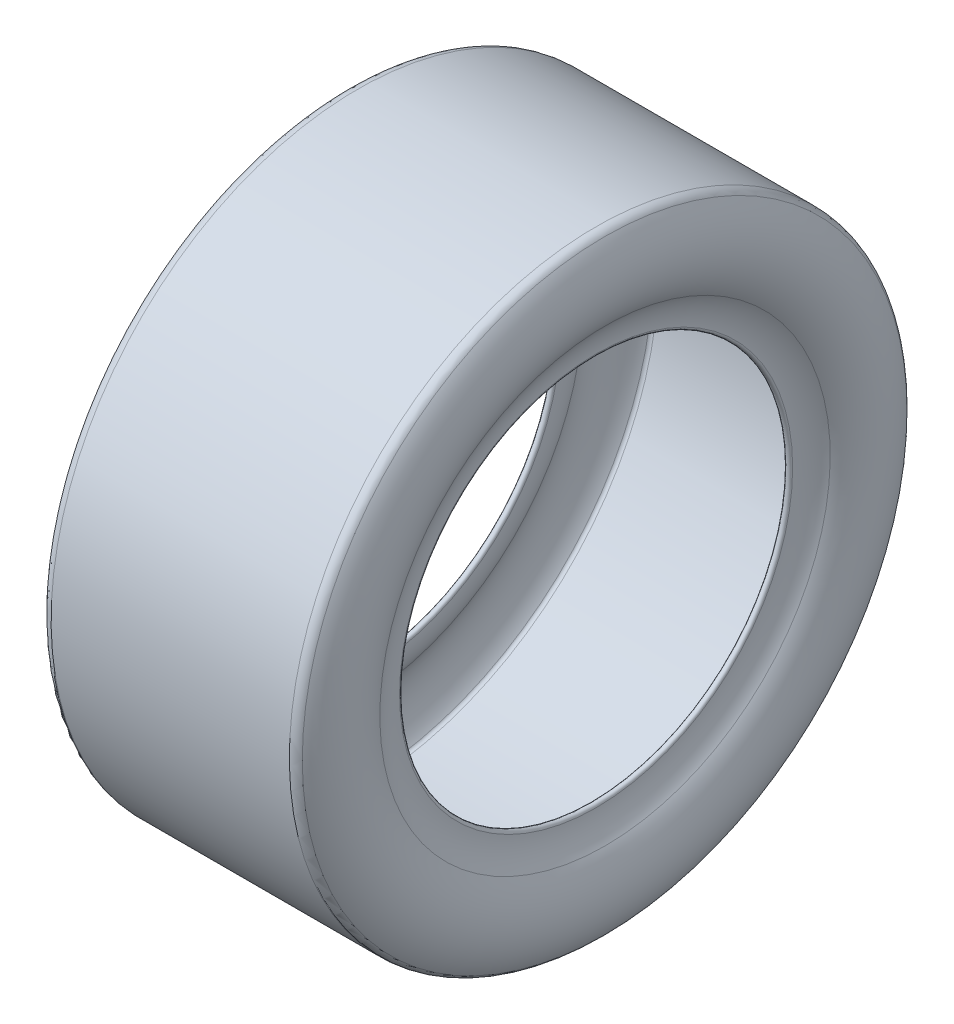
ISO-10303-21;
HEADER;
FILE_DESCRIPTION(('STEP AP214'),'2;1');
FILE_NAME('part.step','',(''),(''),'','','');
FILE_SCHEMA(('AUTOMOTIVE_DESIGN { 1 0 10303 214 1 1 1 1 }'));
ENDSEC;
DATA;
#1=APPLICATION_CONTEXT('core data for automotive mechanical design processes');
#2=APPLICATION_PROTOCOL_DEFINITION('international standard','automotive_design',2000,#1);
#3=PRODUCT_CONTEXT('',#1,'mechanical');
#4=PRODUCT('Part','Part','',(#3));
#5=PRODUCT_RELATED_PRODUCT_CATEGORY('part','',(#4));
#6=PRODUCT_DEFINITION_FORMATION('','',#4);
#7=PRODUCT_DEFINITION_CONTEXT('part definition',#1,'design');
#8=PRODUCT_DEFINITION('design','',#6,#7);
#9=PRODUCT_DEFINITION_SHAPE('','',#8);
#10=(LENGTH_UNIT() NAMED_UNIT(*) SI_UNIT(.MILLI.,.METRE.));
#11=(NAMED_UNIT(*) PLANE_ANGLE_UNIT() SI_UNIT($,.RADIAN.));
#12=(NAMED_UNIT(*) SI_UNIT($,.STERADIAN.) SOLID_ANGLE_UNIT());
#13=UNCERTAINTY_MEASURE_WITH_UNIT(LENGTH_MEASURE(1.E-05),#10,'distance_accuracy_value','');
#14=(GEOMETRIC_REPRESENTATION_CONTEXT(3) GLOBAL_UNCERTAINTY_ASSIGNED_CONTEXT((#13)) GLOBAL_UNIT_ASSIGNED_CONTEXT((#10,
#11,#12)) REPRESENTATION_CONTEXT('',''));
#15=CARTESIAN_POINT('',(0.,0.,0.));
#16=DIRECTION('',(0.,0.,1.));
#17=DIRECTION('',(1.,0.,0.));
#18=AXIS2_PLACEMENT_3D('',#15,#16,#17);
#19=CARTESIAN_POINT('',(-101.6,0.,0.));
#20=DIRECTION('',(-1.,0.,0.));
#21=DIRECTION('',(0.,-1.,0.));
#22=AXIS2_PLACEMENT_3D('',#19,#20,#21);
#23=TOROIDAL_SURFACE('',#22,252.733463857242,8.88653614275802);
#24=CARTESIAN_POINT('',(-108.860167055037,0.,0.));
#25=DIRECTION('',(-1.,0.,0.));
#26=DIRECTION('',(0.,-1.,0.));
#27=AXIS2_PLACEMENT_3D('',#24,#25,#26);
#28=CIRCLE('',#27,257.857963730351);
#29=CARTESIAN_POINT('',(-108.860167055037,-257.857963730351,0.));
#30=VERTEX_POINT('',#29);
#31=EDGE_CURVE('E10',#30,#30,#28,.T.);
#32=ORIENTED_EDGE('',*,*,#31,.F.);
#33=EDGE_LOOP('',(#32));
#34=FACE_BOUND('',#33,.T.);
#35=CARTESIAN_POINT('',(-101.6,0.,0.));
#36=DIRECTION('',(-1.,0.,0.));
#37=DIRECTION('',(0.,-1.,0.));
#38=AXIS2_PLACEMENT_3D('',#35,#36,#37);
#39=CIRCLE('',#38,261.62);
#40=CARTESIAN_POINT('',(-101.6,-261.62,0.));
#41=VERTEX_POINT('',#40);
#42=EDGE_CURVE('E82',#41,#41,#39,.T.);
#43=ORIENTED_EDGE('',*,*,#42,.T.);
#44=EDGE_LOOP('',(#43));
#45=FACE_BOUND('',#44,.T.);
#46=ADVANCED_FACE('F30',(#34,#45),#23,.T.);
#47=CARTESIAN_POINT('',(-61.8992741383217,0.,0.));
#48=DIRECTION('',(-1.,0.,0.));
#49=DIRECTION('',(0.,-1.,0.));
#50=AXIS2_PLACEMENT_3D('',#47,#48,#49);
#51=TOROIDAL_SURFACE('',#50,224.711193419351,57.4807258616782);
#52=CARTESIAN_POINT('',(-109.209263361328,0.,0.));
#53=DIRECTION('',(-1.,0.,0.));
#54=DIRECTION('',(0.,-1.,0.));
#55=AXIS2_PLACEMENT_3D('',#52,#53,#54);
#56=CIRCLE('',#55,192.064619857882);
#57=CARTESIAN_POINT('',(-109.209263361328,-192.064619857882,0.));
#58=VERTEX_POINT('',#57);
#59=EDGE_CURVE('E36',#58,#58,#56,.T.);
#60=ORIENTED_EDGE('',*,*,#59,.F.);
#61=EDGE_LOOP('',(#60));
#62=FACE_BOUND('',#61,.T.);
#63=ORIENTED_EDGE('',*,*,#31,.T.);
#64=EDGE_LOOP('',(#63));
#65=FACE_BOUND('',#64,.T.);
#66=ADVANCED_FACE('F167',(#62,#65),#51,.T.);
#67=CARTESIAN_POINT('',(-144.604356205504,0.,0.));
#68=DIRECTION('',(-1.,0.,0.));
#69=DIRECTION('',(0.,-1.,0.));
#70=AXIS2_PLACEMENT_3D('',#67,#68,#69);
#71=TOROIDAL_SURFACE('',#70,167.64,43.0043562055043);
#72=CARTESIAN_POINT('',(-101.6,0.,0.));
#73=DIRECTION('',(-1.,0.,0.));
#74=DIRECTION('',(0.,-1.,0.));
#75=AXIS2_PLACEMENT_3D('',#72,#73,#74);
#76=CIRCLE('',#75,167.64);
#77=CARTESIAN_POINT('',(-101.6,-167.64,0.));
#78=VERTEX_POINT('',#77);
#79=EDGE_CURVE('E40',#78,#78,#76,.T.);
#80=ORIENTED_EDGE('',*,*,#79,.F.);
#81=EDGE_LOOP('',(#80));
#82=FACE_BOUND('',#81,.T.);
#83=ORIENTED_EDGE('',*,*,#59,.T.);
#84=EDGE_LOOP('',(#83));
#85=FACE_BOUND('',#84,.T.);
#86=ADVANCED_FACE('F162',(#82,#85),#71,.F.);
#87=CARTESIAN_POINT('',(-99.06,0.,0.));
#88=DIRECTION('',(-1.,0.,0.));
#89=DIRECTION('',(0.,-1.,0.));
#90=AXIS2_PLACEMENT_3D('',#87,#88,#89);
#91=TOROIDAL_SURFACE('',#90,167.64,2.53999999999999);
#92=CARTESIAN_POINT('',(-96.52,0.,0.));
#93=DIRECTION('',(-1.,0.,0.));
#94=DIRECTION('',(0.,-1.,0.));
#95=AXIS2_PLACEMENT_3D('',#92,#93,#94);
#96=CIRCLE('',#95,167.64);
#97=CARTESIAN_POINT('',(-96.5199999999999,-167.64,0.));
#98=VERTEX_POINT('',#97);
#99=EDGE_CURVE('E44',#98,#98,#96,.T.);
#100=ORIENTED_EDGE('',*,*,#99,.F.);
#101=EDGE_LOOP('',(#100));
#102=FACE_BOUND('',#101,.T.);
#103=ORIENTED_EDGE('',*,*,#79,.T.);
#104=EDGE_LOOP('',(#103));
#105=FACE_BOUND('',#104,.T.);
#106=ADVANCED_FACE('F156',(#102,#105),#91,.T.);
#107=CARTESIAN_POINT('',(-144.604356205504,0.,0.));
#108=DIRECTION('',(-1.,0.,0.));
#109=DIRECTION('',(0.,-1.,0.));
#110=AXIS2_PLACEMENT_3D('',#107,#108,#109);
#111=TOROIDAL_SURFACE('',#110,167.64,48.0843562055044);
#112=CARTESIAN_POINT('',(-105.028127134357,0.,0.));
#113=DIRECTION('',(-1.,0.,0.));
#114=DIRECTION('',(0.,-1.,0.));
#115=AXIS2_PLACEMENT_3D('',#112,#113,#114);
#116=CIRCLE('',#115,194.949840794224);
#117=CARTESIAN_POINT('',(-105.028127134357,-194.949840794224,0.));
#118=VERTEX_POINT('',#117);
#119=EDGE_CURVE('E49',#118,#118,#116,.T.);
#120=ORIENTED_EDGE('',*,*,#119,.F.);
#121=EDGE_LOOP('',(#120));
#122=FACE_BOUND('',#121,.T.);
#123=ORIENTED_EDGE('',*,*,#99,.T.);
#124=EDGE_LOOP('',(#123));
#125=FACE_BOUND('',#124,.T.);
#126=ADVANCED_FACE('F150',(#122,#125),#111,.T.);
#127=CARTESIAN_POINT('',(-61.8992741383217,0.,0.));
#128=DIRECTION('',(-1.,0.,0.));
#129=DIRECTION('',(0.,-1.,0.));
#130=AXIS2_PLACEMENT_3D('',#127,#128,#129);
#131=TOROIDAL_SURFACE('',#130,224.711193419351,52.400725861678);
#132=CARTESIAN_POINT('',(-104.709883069567,0.,0.));
#133=DIRECTION('',(-1.,0.,0.));
#134=DIRECTION('',(0.,-1.,0.));
#135=AXIS2_PLACEMENT_3D('',#132,#133,#134);
#136=CIRCLE('',#135,254.928536680576);
#137=CARTESIAN_POINT('',(-104.709883069567,-254.928536680576,0.));
#138=VERTEX_POINT('',#137);
#139=EDGE_CURVE('E52',#138,#138,#136,.T.);
#140=ORIENTED_EDGE('',*,*,#139,.F.);
#141=EDGE_LOOP('',(#140));
#142=FACE_BOUND('',#141,.T.);
#143=ORIENTED_EDGE('',*,*,#119,.T.);
#144=EDGE_LOOP('',(#143));
#145=FACE_BOUND('',#144,.T.);
#146=ADVANCED_FACE('F144',(#142,#145),#131,.F.);
#147=CARTESIAN_POINT('',(-101.6,0.,0.));
#148=DIRECTION('',(-1.,0.,0.));
#149=DIRECTION('',(0.,-1.,0.));
#150=AXIS2_PLACEMENT_3D('',#147,#148,#149);
#151=TOROIDAL_SURFACE('',#150,252.733463857242,3.80653614275777);
#152=CARTESIAN_POINT('',(-101.6,0.,0.));
#153=DIRECTION('',(-1.,0.,0.));
#154=DIRECTION('',(0.,-1.,0.));
#155=AXIS2_PLACEMENT_3D('',#152,#153,#154);
#156=CIRCLE('',#155,256.54);
#157=CARTESIAN_POINT('',(-101.6,-256.54,0.));
#158=VERTEX_POINT('',#157);
#159=EDGE_CURVE('E55',#158,#158,#156,.T.);
#160=ORIENTED_EDGE('',*,*,#159,.F.);
#161=EDGE_LOOP('',(#160));
#162=FACE_BOUND('',#161,.T.);
#163=ORIENTED_EDGE('',*,*,#139,.T.);
#164=EDGE_LOOP('',(#163));
#165=FACE_BOUND('',#164,.T.);
#166=ADVANCED_FACE('F138',(#162,#165),#151,.F.);
#167=CARTESIAN_POINT('',(-23.1787160204675,0.,0.));
#168=DIRECTION('',(-1.,0.,0.));
#169=DIRECTION('',(0.,-1.,0.));
#170=AXIS2_PLACEMENT_3D('',#167,#168,#169);
#171=CYLINDRICAL_SURFACE('',#170,256.54);
#172=CARTESIAN_POINT('',(101.6,0.,0.));
#173=DIRECTION('',(-1.,0.,0.));
#174=DIRECTION('',(0.,-1.,0.));
#175=AXIS2_PLACEMENT_3D('',#172,#173,#174);
#176=CIRCLE('',#175,256.54);
#177=CARTESIAN_POINT('',(101.6,-256.54,0.));
#178=VERTEX_POINT('',#177);
#179=EDGE_CURVE('E58',#178,#178,#176,.T.);
#180=ORIENTED_EDGE('',*,*,#179,.F.);
#181=EDGE_LOOP('',(#180));
#182=FACE_BOUND('',#181,.T.);
#183=ORIENTED_EDGE('',*,*,#159,.T.);
#184=EDGE_LOOP('',(#183));
#185=FACE_BOUND('',#184,.T.);
#186=ADVANCED_FACE('F132',(#182,#185),#171,.F.);
#187=CARTESIAN_POINT('',(101.6,0.,0.));
#188=DIRECTION('',(-1.,0.,0.));
#189=DIRECTION('',(0.,-1.,0.));
#190=AXIS2_PLACEMENT_3D('',#187,#188,#189);
#191=TOROIDAL_SURFACE('',#190,252.733463857242,3.80653614275777);
#192=CARTESIAN_POINT('',(104.709883069567,0.,0.));
#193=DIRECTION('',(-1.,0.,0.));
#194=DIRECTION('',(0.,-1.,0.));
#195=AXIS2_PLACEMENT_3D('',#192,#193,#194);
#196=CIRCLE('',#195,254.928536680576);
#197=CARTESIAN_POINT('',(104.709883069567,-254.928536680576,0.));
#198=VERTEX_POINT('',#197);
#199=EDGE_CURVE('E61',#198,#198,#196,.T.);
#200=ORIENTED_EDGE('',*,*,#199,.F.);
#201=EDGE_LOOP('',(#200));
#202=FACE_BOUND('',#201,.T.);
#203=ORIENTED_EDGE('',*,*,#179,.T.);
#204=EDGE_LOOP('',(#203));
#205=FACE_BOUND('',#204,.T.);
#206=ADVANCED_FACE('F126',(#202,#205),#191,.F.);
#207=CARTESIAN_POINT('',(61.8992741383218,0.,0.));
#208=DIRECTION('',(-1.,0.,0.));
#209=DIRECTION('',(0.,-1.,0.));
#210=AXIS2_PLACEMENT_3D('',#207,#208,#209);
#211=TOROIDAL_SURFACE('',#210,224.711193419351,52.400725861678);
#212=CARTESIAN_POINT('',(105.028127134357,0.,0.));
#213=DIRECTION('',(-1.,0.,0.));
#214=DIRECTION('',(0.,-1.,0.));
#215=AXIS2_PLACEMENT_3D('',#212,#213,#214);
#216=CIRCLE('',#215,194.949840794224);
#217=CARTESIAN_POINT('',(105.028127134357,-194.949840794224,0.));
#218=VERTEX_POINT('',#217);
#219=EDGE_CURVE('E64',#218,#218,#216,.T.);
#220=ORIENTED_EDGE('',*,*,#219,.F.);
#221=EDGE_LOOP('',(#220));
#222=FACE_BOUND('',#221,.T.);
#223=ORIENTED_EDGE('',*,*,#199,.T.);
#224=EDGE_LOOP('',(#223));
#225=FACE_BOUND('',#224,.T.);
#226=ADVANCED_FACE('F120',(#222,#225),#211,.F.);
#227=CARTESIAN_POINT('',(144.604356205504,0.,0.));
#228=DIRECTION('',(-1.,0.,0.));
#229=DIRECTION('',(0.,-1.,0.));
#230=AXIS2_PLACEMENT_3D('',#227,#228,#229);
#231=TOROIDAL_SURFACE('',#230,167.64,48.0843562055044);
#232=CARTESIAN_POINT('',(96.52,0.,0.));
#233=DIRECTION('',(-1.,0.,0.));
#234=DIRECTION('',(0.,-1.,0.));
#235=AXIS2_PLACEMENT_3D('',#232,#233,#234);
#236=CIRCLE('',#235,167.64);
#237=CARTESIAN_POINT('',(96.5200000000001,-167.64,0.));
#238=VERTEX_POINT('',#237);
#239=EDGE_CURVE('E67',#238,#238,#236,.T.);
#240=ORIENTED_EDGE('',*,*,#239,.F.);
#241=EDGE_LOOP('',(#240));
#242=FACE_BOUND('',#241,.T.);
#243=ORIENTED_EDGE('',*,*,#219,.T.);
#244=EDGE_LOOP('',(#243));
#245=FACE_BOUND('',#244,.T.);
#246=ADVANCED_FACE('F114',(#242,#245),#231,.T.);
#247=CARTESIAN_POINT('',(99.06,0.,0.));
#248=DIRECTION('',(-1.,0.,0.));
#249=DIRECTION('',(0.,-1.,0.));
#250=AXIS2_PLACEMENT_3D('',#247,#248,#249);
#251=TOROIDAL_SURFACE('',#250,167.64,2.53999999999999);
#252=CARTESIAN_POINT('',(101.6,0.,0.));
#253=DIRECTION('',(-1.,0.,0.));
#254=DIRECTION('',(0.,-1.,0.));
#255=AXIS2_PLACEMENT_3D('',#252,#253,#254);
#256=CIRCLE('',#255,167.64);
#257=CARTESIAN_POINT('',(101.6,-167.64,0.));
#258=VERTEX_POINT('',#257);
#259=EDGE_CURVE('E70',#258,#258,#256,.T.);
#260=ORIENTED_EDGE('',*,*,#259,.F.);
#261=EDGE_LOOP('',(#260));
#262=FACE_BOUND('',#261,.T.);
#263=ORIENTED_EDGE('',*,*,#239,.T.);
#264=EDGE_LOOP('',(#263));
#265=FACE_BOUND('',#264,.T.);
#266=ADVANCED_FACE('F108',(#262,#265),#251,.T.);
#267=CARTESIAN_POINT('',(144.604356205504,0.,0.));
#268=DIRECTION('',(-1.,0.,0.));
#269=DIRECTION('',(0.,-1.,0.));
#270=AXIS2_PLACEMENT_3D('',#267,#268,#269);
#271=TOROIDAL_SURFACE('',#270,167.64,43.0043562055043);
#272=CARTESIAN_POINT('',(109.209263361328,0.,0.));
#273=DIRECTION('',(-1.,0.,0.));
#274=DIRECTION('',(0.,-1.,0.));
#275=AXIS2_PLACEMENT_3D('',#272,#273,#274);
#276=CIRCLE('',#275,192.064619857882);
#277=CARTESIAN_POINT('',(109.209263361328,-192.064619857882,0.));
#278=VERTEX_POINT('',#277);
#279=EDGE_CURVE('E73',#278,#278,#276,.T.);
#280=ORIENTED_EDGE('',*,*,#279,.F.);
#281=EDGE_LOOP('',(#280));
#282=FACE_BOUND('',#281,.T.);
#283=ORIENTED_EDGE('',*,*,#259,.T.);
#284=EDGE_LOOP('',(#283));
#285=FACE_BOUND('',#284,.T.);
#286=ADVANCED_FACE('F102',(#282,#285),#271,.F.);
#287=CARTESIAN_POINT('',(61.8992741383218,0.,0.));
#288=DIRECTION('',(-1.,0.,0.));
#289=DIRECTION('',(0.,-1.,0.));
#290=AXIS2_PLACEMENT_3D('',#287,#288,#289);
#291=TOROIDAL_SURFACE('',#290,224.711193419351,57.4807258616782);
#292=CARTESIAN_POINT('',(108.860167055037,0.,0.));
#293=DIRECTION('',(-1.,0.,0.));
#294=DIRECTION('',(0.,-1.,0.));
#295=AXIS2_PLACEMENT_3D('',#292,#293,#294);
#296=CIRCLE('',#295,257.857963730351);
#297=CARTESIAN_POINT('',(108.860167055037,-257.857963730351,0.));
#298=VERTEX_POINT('',#297);
#299=EDGE_CURVE('E76',#298,#298,#296,.T.);
#300=ORIENTED_EDGE('',*,*,#299,.F.);
#301=EDGE_LOOP('',(#300));
#302=FACE_BOUND('',#301,.T.);
#303=ORIENTED_EDGE('',*,*,#279,.T.);
#304=EDGE_LOOP('',(#303));
#305=FACE_BOUND('',#304,.T.);
#306=ADVANCED_FACE('F96',(#302,#305),#291,.T.);
#307=CARTESIAN_POINT('',(101.6,0.,0.));
#308=DIRECTION('',(-1.,0.,0.));
#309=DIRECTION('',(0.,-1.,0.));
#310=AXIS2_PLACEMENT_3D('',#307,#308,#309);
#311=TOROIDAL_SURFACE('',#310,252.733463857242,8.88653614275802);
#312=CARTESIAN_POINT('',(101.6,0.,0.));
#313=DIRECTION('',(-1.,0.,0.));
#314=DIRECTION('',(0.,-1.,0.));
#315=AXIS2_PLACEMENT_3D('',#312,#313,#314);
#316=CIRCLE('',#315,261.62);
#317=CARTESIAN_POINT('',(101.6,-261.62,0.));
#318=VERTEX_POINT('',#317);
#319=EDGE_CURVE('E79',#318,#318,#316,.T.);
#320=ORIENTED_EDGE('',*,*,#319,.F.);
#321=EDGE_LOOP('',(#320));
#322=FACE_BOUND('',#321,.T.);
#323=ORIENTED_EDGE('',*,*,#299,.T.);
#324=EDGE_LOOP('',(#323));
#325=FACE_BOUND('',#324,.T.);
#326=ADVANCED_FACE('F90',(#322,#325),#311,.T.);
#327=CARTESIAN_POINT('',(-23.1787160204675,0.,0.));
#328=DIRECTION('',(-1.,0.,0.));
#329=DIRECTION('',(0.,-1.,0.));
#330=AXIS2_PLACEMENT_3D('',#327,#328,#329);
#331=CYLINDRICAL_SURFACE('',#330,261.62);
#332=ORIENTED_EDGE('',*,*,#42,.F.);
#333=EDGE_LOOP('',(#332));
#334=FACE_BOUND('',#333,.T.);
#335=ORIENTED_EDGE('',*,*,#319,.T.);
#336=EDGE_LOOP('',(#335));
#337=FACE_BOUND('',#336,.T.);
#338=ADVANCED_FACE('F87',(#334,#337),#331,.T.);
#339=CLOSED_SHELL('',(#46,#66,#86,#106,#126,#146,#166,#186,#206,#226,#246,#266,#286,#306,#326,#338));
#340=MANIFOLD_SOLID_BREP('B2',#339);
#341=ADVANCED_BREP_SHAPE_REPRESENTATION('',(#18,#340),#14);
#342=SHAPE_DEFINITION_REPRESENTATION(#9,#341);
ENDSEC;
END-ISO-10303-21;
